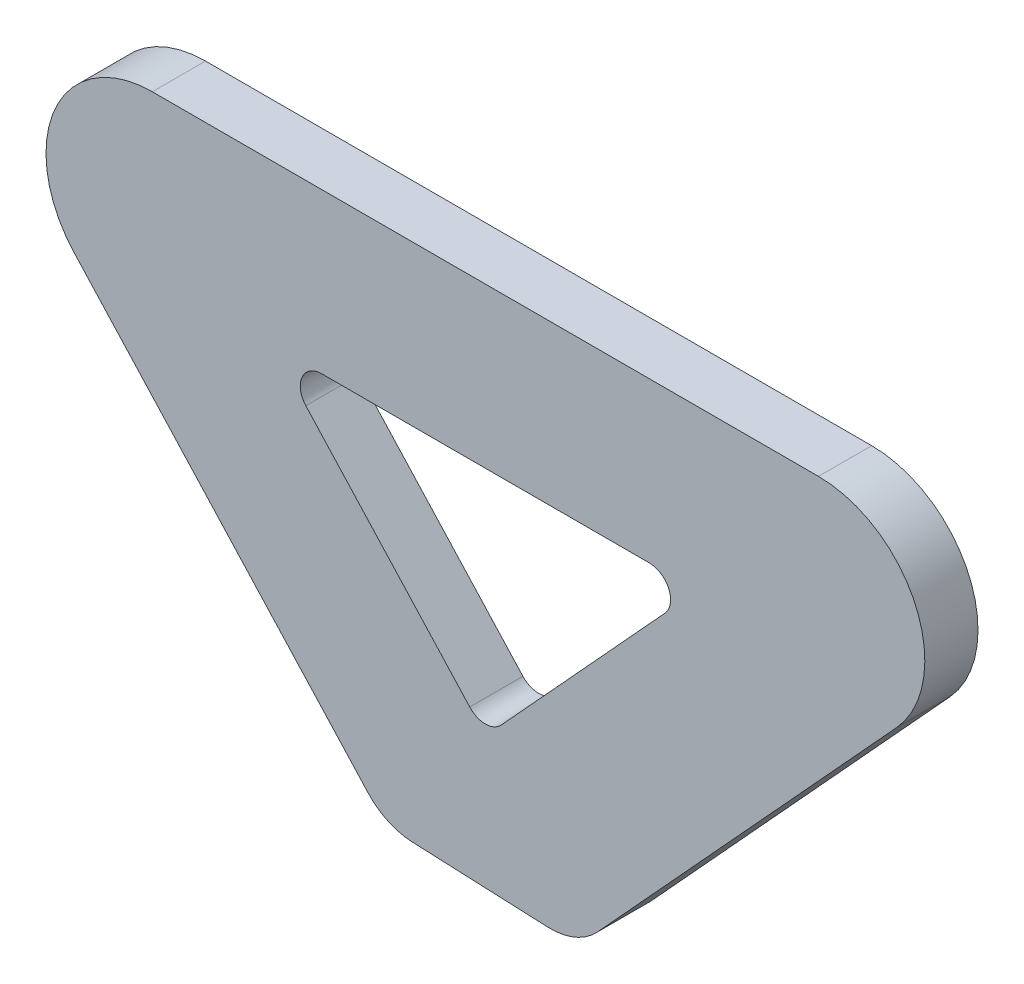
ISO-10303-21;
HEADER;
FILE_DESCRIPTION(('STEP AP214'),'2;1');
FILE_NAME('part.step','',(''),(''),'','','');
FILE_SCHEMA(('AUTOMOTIVE_DESIGN { 1 0 10303 214 1 1 1 1 }'));
ENDSEC;
DATA;
#1=APPLICATION_CONTEXT('core data for automotive mechanical design processes');
#2=APPLICATION_PROTOCOL_DEFINITION('international standard','automotive_design',2000,#1);
#3=PRODUCT_CONTEXT('',#1,'mechanical');
#4=PRODUCT('Part','Part','',(#3));
#5=PRODUCT_RELATED_PRODUCT_CATEGORY('part','',(#4));
#6=PRODUCT_DEFINITION_FORMATION('','',#4);
#7=PRODUCT_DEFINITION_CONTEXT('part definition',#1,'design');
#8=PRODUCT_DEFINITION('design','',#6,#7);
#9=PRODUCT_DEFINITION_SHAPE('','',#8);
#10=(LENGTH_UNIT() NAMED_UNIT(*) SI_UNIT(.MILLI.,.METRE.));
#11=(NAMED_UNIT(*) PLANE_ANGLE_UNIT() SI_UNIT($,.RADIAN.));
#12=(NAMED_UNIT(*) SI_UNIT($,.STERADIAN.) SOLID_ANGLE_UNIT());
#13=UNCERTAINTY_MEASURE_WITH_UNIT(LENGTH_MEASURE(1.E-05),#10,'distance_accuracy_value','');
#14=(GEOMETRIC_REPRESENTATION_CONTEXT(3) GLOBAL_UNCERTAINTY_ASSIGNED_CONTEXT((#13)) GLOBAL_UNIT_ASSIGNED_CONTEXT((#10,
#11,#12)) REPRESENTATION_CONTEXT('',''));
#15=CARTESIAN_POINT('',(0.,0.,0.));
#16=DIRECTION('',(0.,0.,1.));
#17=DIRECTION('',(1.,0.,0.));
#18=AXIS2_PLACEMENT_3D('',#15,#16,#17);
#19=CARTESIAN_POINT('',(39.7716912999365,-12.7000000000003,6.35));
#20=DIRECTION('',(0.,0.,1.));
#21=DIRECTION('',(1.,0.,0.));
#22=AXIS2_PLACEMENT_3D('',#19,#20,#21);
#23=PLANE('',#22);
#24=DIRECTION('',(-0.99904171323689,0.0437681986458256,0.));
#25=VECTOR('',#24,1.);
#26=CARTESIAN_POINT('',(37.5202773848138,-64.0901984673981,6.35));
#27=LINE('',#26,#25);
#28=CARTESIAN_POINT('',(-8.74868159884013,-62.0631469828602,6.35));
#29=VERTEX_POINT('',#28);
#30=CARTESIAN_POINT('',(7.4322700803087,-62.772037410545,6.35));
#31=VERTEX_POINT('',#30);
#32=EDGE_CURVE('E176',#29,#31,#27,.F.);
#33=ORIENTED_EDGE('',*,*,#32,.T.);
#34=CARTESIAN_POINT('',(7.7657837539899,-55.1593395556799,6.35));
#35=DIRECTION('',(0.,0.,1.));
#36=DIRECTION('',(1.,0.,0.));
#37=AXIS2_PLACEMENT_3D('',#34,#35,#36);
#38=CIRCLE('',#37,7.62);
#39=CARTESIAN_POINT('',(13.3846038105677,-60.306500051701,6.35));
#40=VERTEX_POINT('',#39);
#41=EDGE_CURVE('E48',#31,#40,#38,.T.);
#42=ORIENTED_EDGE('',*,*,#41,.T.);
#43=DIRECTION('',(0.675480380055254,0.737377960180808,0.));
#44=VECTOR('',#43,1.);
#45=CARTESIAN_POINT('',(-2.63677968348475E-13,-74.9176007543706,6.35));
#46=LINE('',#45,#44);
#47=CARTESIAN_POINT('',(49.1363913942325,-21.2786008267022,6.35));
#48=VERTEX_POINT('',#47);
#49=EDGE_CURVE('E142',#40,#48,#46,.T.);
#50=ORIENTED_EDGE('',*,*,#49,.T.);
#51=CARTESIAN_POINT('',(39.7716912999365,-12.7000000000003,6.35));
#52=DIRECTION('',(0.,0.,1.));
#53=DIRECTION('',(1.,0.,0.));
#54=AXIS2_PLACEMENT_3D('',#51,#52,#53);
#55=CIRCLE('',#54,12.7);
#56=CARTESIAN_POINT('',(39.7716912999363,-2.77555756156289E-13,6.35));
#57=VERTEX_POINT('',#56);
#58=EDGE_CURVE('E145',#48,#57,#55,.T.);
#59=ORIENTED_EDGE('',*,*,#58,.T.);
#60=DIRECTION('',(-1.,0.,0.));
#61=VECTOR('',#60,1.);
#62=CARTESIAN_POINT('',(39.7716912999363,-2.77555756156289E-13,6.35));
#63=LINE('',#62,#61);
#64=CARTESIAN_POINT('',(-39.7716912999363,0.,6.35));
#65=VERTEX_POINT('',#64);
#66=EDGE_CURVE('E164',#57,#65,#63,.T.);
#67=ORIENTED_EDGE('',*,*,#66,.T.);
#68=CARTESIAN_POINT('',(-39.7716912999365,-12.7,6.35));
#69=DIRECTION('',(0.,0.,1.));
#70=DIRECTION('',(-1.,0.,0.));
#71=AXIS2_PLACEMENT_3D('',#68,#69,#70);
#72=CIRCLE('',#71,12.7);
#73=CARTESIAN_POINT('',(-49.1363913942327,-21.2786008267019,6.35));
#74=VERTEX_POINT('',#73);
#75=EDGE_CURVE('E270',#65,#74,#72,.T.);
#76=ORIENTED_EDGE('',*,*,#75,.T.);
#77=DIRECTION('',(0.675480380055249,-0.737377960180813,0.));
#78=VECTOR('',#77,1.);
#79=CARTESIAN_POINT('',(-2.63677968348475E-13,-74.9176007543706,6.35));
#80=LINE('',#79,#78);
#81=CARTESIAN_POINT('',(-14.0339879817367,-59.5976096240161,6.35));
#82=VERTEX_POINT('',#81);
#83=EDGE_CURVE('E241',#74,#82,#80,.T.);
#84=ORIENTED_EDGE('',*,*,#83,.T.);
#85=CARTESIAN_POINT('',(-8.41516792515893,-54.4504491279951,6.35));
#86=DIRECTION('',(0.,0.,1.));
#87=DIRECTION('',(1.,0.,0.));
#88=AXIS2_PLACEMENT_3D('',#85,#86,#87);
#89=CIRCLE('',#88,7.62);
#90=EDGE_CURVE('E55',#82,#29,#89,.T.);
#91=ORIENTED_EDGE('',*,*,#90,.T.);
#92=EDGE_LOOP('',(#33,#42,#50,#59,#67,#76,#84,#91));
#93=FACE_BOUND('',#92,.T.);
#94=DIRECTION('',(0.675480380055254,0.737377960180808,0.));
#95=VECTOR('',#94,1.);
#96=CARTESIAN_POINT('',(-1.61329283265843E-13,-46.7154492744981,6.35));
#97=LINE('',#96,#95);
#98=CARTESIAN_POINT('',(1.8729400188591,-44.6708825758555,6.35));
#99=VERTEX_POINT('',#98);
#100=CARTESIAN_POINT('',(21.4446505992218,-23.3057201653403,6.35));
#101=VERTEX_POINT('',#100);
#102=EDGE_CURVE('E288',#99,#101,#97,.T.);
#103=ORIENTED_EDGE('',*,*,#102,.F.);
#104=CARTESIAN_POINT('',(-1.47885176327023E-13,-42.9551624105152,6.35));
#105=DIRECTION('',(0.,0.,1.));
#106=DIRECTION('',(1.,0.,0.));
#107=AXIS2_PLACEMENT_3D('',#104,#105,#106);
#108=CIRCLE('',#107,2.54);
#109=CARTESIAN_POINT('',(-1.87294001885941,-44.6708825758555,6.35));
#110=VERTEX_POINT('',#109);
#111=EDGE_CURVE('E214',#99,#110,#108,.F.);
#112=ORIENTED_EDGE('',*,*,#111,.T.);
#113=DIRECTION('',(0.675480380055249,-0.737377960180813,0.));
#114=VECTOR('',#113,1.);
#115=CARTESIAN_POINT('',(-1.61329283265843E-13,-46.7154492744981,6.35));
#116=LINE('',#115,#114);
#117=CARTESIAN_POINT('',(-21.4446505992219,-23.3057201653403,6.35));
#118=VERTEX_POINT('',#117);
#119=EDGE_CURVE('E295',#118,#110,#116,.T.);
#120=ORIENTED_EDGE('',*,*,#119,.F.);
#121=CARTESIAN_POINT('',(-19.5717105803626,-21.59,6.35));
#122=DIRECTION('',(0.,0.,1.));
#123=DIRECTION('',(1.,0.,0.));
#124=AXIS2_PLACEMENT_3D('',#121,#122,#123);
#125=CIRCLE('',#124,2.54);
#126=CARTESIAN_POINT('',(-19.5717105803626,-19.0499999999999,6.35));
#127=VERTEX_POINT('',#126);
#128=EDGE_CURVE('E208',#118,#127,#125,.F.);
#129=ORIENTED_EDGE('',*,*,#128,.T.);
#130=DIRECTION('',(-1.,0.,0.));
#131=VECTOR('',#130,1.);
#132=CARTESIAN_POINT('',(25.3431336430979,-19.0500000000002,6.35));
#133=LINE('',#132,#131);
#134=CARTESIAN_POINT('',(19.5717105803626,-19.0500000000001,6.35));
#135=VERTEX_POINT('',#134);
#136=EDGE_CURVE('E285',#135,#127,#133,.T.);
#137=ORIENTED_EDGE('',*,*,#136,.F.);
#138=CARTESIAN_POINT('',(19.5717105803626,-21.59,6.35));
#139=DIRECTION('',(0.,0.,1.));
#140=DIRECTION('',(1.,0.,0.));
#141=AXIS2_PLACEMENT_3D('',#138,#139,#140);
#142=CIRCLE('',#141,2.54);
#143=EDGE_CURVE('E220',#135,#101,#142,.F.);
#144=ORIENTED_EDGE('',*,*,#143,.T.);
#145=EDGE_LOOP('',(#103,#112,#120,#129,#137,#144));
#146=FACE_BOUND('',#145,.T.);
#147=ADVANCED_FACE('F39',(#93,#146),#23,.T.);
#148=CARTESIAN_POINT('',(39.7716912999365,-12.7000000000003,0.));
#149=DIRECTION('',(0.,0.,1.));
#150=DIRECTION('',(1.,0.,0.));
#151=AXIS2_PLACEMENT_3D('',#148,#149,#150);
#152=PLANE('',#151);
#153=DIRECTION('',(0.675480380055254,0.737377960180808,0.));
#154=VECTOR('',#153,1.);
#155=CARTESIAN_POINT('',(-2.63677968348475E-13,-74.9176007543706,0.));
#156=LINE('',#155,#154);
#157=CARTESIAN_POINT('',(13.3846038105677,-60.306500051701,0.));
#158=VERTEX_POINT('',#157);
#159=CARTESIAN_POINT('',(49.1363913942325,-21.2786008267022,0.));
#160=VERTEX_POINT('',#159);
#161=EDGE_CURVE('E168',#158,#160,#156,.T.);
#162=ORIENTED_EDGE('',*,*,#161,.F.);
#163=CARTESIAN_POINT('',(7.7657837539899,-55.1593395556799,0.));
#164=DIRECTION('',(0.,0.,1.));
#165=DIRECTION('',(1.,0.,0.));
#166=AXIS2_PLACEMENT_3D('',#163,#164,#165);
#167=CIRCLE('',#166,7.62);
#168=CARTESIAN_POINT('',(7.43227008030871,-62.772037410545,0.));
#169=VERTEX_POINT('',#168);
#170=EDGE_CURVE('E229',#158,#169,#167,.F.);
#171=ORIENTED_EDGE('',*,*,#170,.T.);
#172=DIRECTION('',(0.99904171323689,-0.0437681986458256,0.));
#173=VECTOR('',#172,1.);
#174=CARTESIAN_POINT('',(10.9835099901653,-62.9276178750584,0.));
#175=LINE('',#174,#173);
#176=CARTESIAN_POINT('',(-8.74868159884012,-62.0631469828602,0.));
#177=VERTEX_POINT('',#176);
#178=EDGE_CURVE('E171',#169,#177,#175,.F.);
#179=ORIENTED_EDGE('',*,*,#178,.T.);
#180=CARTESIAN_POINT('',(-8.41516792515893,-54.4504491279951,0.));
#181=DIRECTION('',(0.,0.,1.));
#182=DIRECTION('',(1.,0.,0.));
#183=AXIS2_PLACEMENT_3D('',#180,#181,#182);
#184=CIRCLE('',#183,7.62);
#185=CARTESIAN_POINT('',(-14.0339879817367,-59.5976096240161,0.));
#186=VERTEX_POINT('',#185);
#187=EDGE_CURVE('E226',#177,#186,#184,.F.);
#188=ORIENTED_EDGE('',*,*,#187,.T.);
#189=DIRECTION('',(0.675480380055249,-0.737377960180813,0.));
#190=VECTOR('',#189,1.);
#191=CARTESIAN_POINT('',(-2.63677968348475E-13,-74.9176007543706,0.));
#192=LINE('',#191,#190);
#193=CARTESIAN_POINT('',(-49.1363913942327,-21.2786008267019,0.));
#194=VERTEX_POINT('',#193);
#195=EDGE_CURVE('E153',#194,#186,#192,.T.);
#196=ORIENTED_EDGE('',*,*,#195,.F.);
#197=CARTESIAN_POINT('',(-39.7716912999365,-12.7,0.));
#198=DIRECTION('',(0.,0.,1.));
#199=DIRECTION('',(-1.,0.,0.));
#200=AXIS2_PLACEMENT_3D('',#197,#198,#199);
#201=CIRCLE('',#200,12.7);
#202=CARTESIAN_POINT('',(-39.7716912999363,0.,0.));
#203=VERTEX_POINT('',#202);
#204=EDGE_CURVE('E256',#203,#194,#201,.T.);
#205=ORIENTED_EDGE('',*,*,#204,.F.);
#206=DIRECTION('',(-1.,0.,0.));
#207=VECTOR('',#206,1.);
#208=CARTESIAN_POINT('',(-39.7716912999363,0.,0.));
#209=LINE('',#208,#207);
#210=CARTESIAN_POINT('',(39.7716912999363,-2.77555756156289E-13,0.));
#211=VERTEX_POINT('',#210);
#212=EDGE_CURVE('E259',#211,#203,#209,.T.);
#213=ORIENTED_EDGE('',*,*,#212,.F.);
#214=CARTESIAN_POINT('',(39.7716912999365,-12.7000000000003,0.));
#215=DIRECTION('',(0.,0.,1.));
#216=DIRECTION('',(1.,0.,0.));
#217=AXIS2_PLACEMENT_3D('',#214,#215,#216);
#218=CIRCLE('',#217,12.7);
#219=EDGE_CURVE('E272',#160,#211,#218,.T.);
#220=ORIENTED_EDGE('',*,*,#219,.F.);
#221=EDGE_LOOP('',(#162,#171,#179,#188,#196,#205,#213,#220));
#222=FACE_BOUND('',#221,.T.);
#223=DIRECTION('',(-1.,0.,0.));
#224=VECTOR('',#223,1.);
#225=CARTESIAN_POINT('',(-25.343133643098,-19.05,0.));
#226=LINE('',#225,#224);
#227=CARTESIAN_POINT('',(19.5717105803626,-19.05,0.));
#228=VERTEX_POINT('',#227);
#229=CARTESIAN_POINT('',(-19.5717105803626,-19.05,0.));
#230=VERTEX_POINT('',#229);
#231=EDGE_CURVE('E307',#228,#230,#226,.T.);
#232=ORIENTED_EDGE('',*,*,#231,.T.);
#233=CARTESIAN_POINT('',(-19.5717105803626,-21.59,0.));
#234=DIRECTION('',(0.,0.,1.));
#235=DIRECTION('',(1.,0.,0.));
#236=AXIS2_PLACEMENT_3D('',#233,#234,#235);
#237=CIRCLE('',#236,2.54);
#238=CARTESIAN_POINT('',(-21.4446505992219,-23.3057201653403,0.));
#239=VERTEX_POINT('',#238);
#240=EDGE_CURVE('E205',#230,#239,#237,.T.);
#241=ORIENTED_EDGE('',*,*,#240,.T.);
#242=DIRECTION('',(0.675480380055249,-0.737377960180813,0.));
#243=VECTOR('',#242,1.);
#244=CARTESIAN_POINT('',(-1.61329283265843E-13,-46.7154492744981,0.));
#245=LINE('',#244,#243);
#246=CARTESIAN_POINT('',(-1.87294001885941,-44.6708825758555,0.));
#247=VERTEX_POINT('',#246);
#248=EDGE_CURVE('E299',#239,#247,#245,.T.);
#249=ORIENTED_EDGE('',*,*,#248,.T.);
#250=CARTESIAN_POINT('',(-1.47885176327023E-13,-42.9551624105152,0.));
#251=DIRECTION('',(0.,0.,1.));
#252=DIRECTION('',(1.,0.,0.));
#253=AXIS2_PLACEMENT_3D('',#250,#251,#252);
#254=CIRCLE('',#253,2.54);
#255=CARTESIAN_POINT('',(1.8729400188591,-44.6708825758555,0.));
#256=VERTEX_POINT('',#255);
#257=EDGE_CURVE('E211',#247,#256,#254,.T.);
#258=ORIENTED_EDGE('',*,*,#257,.T.);
#259=DIRECTION('',(0.675480380055254,0.737377960180808,0.));
#260=VECTOR('',#259,1.);
#261=CARTESIAN_POINT('',(-1.61329283265843E-13,-46.7154492744981,0.));
#262=LINE('',#261,#260);
#263=CARTESIAN_POINT('',(21.4446505992218,-23.3057201653403,0.));
#264=VERTEX_POINT('',#263);
#265=EDGE_CURVE('E303',#256,#264,#262,.T.);
#266=ORIENTED_EDGE('',*,*,#265,.T.);
#267=CARTESIAN_POINT('',(19.5717105803626,-21.59,0.));
#268=DIRECTION('',(0.,0.,1.));
#269=DIRECTION('',(1.,0.,0.));
#270=AXIS2_PLACEMENT_3D('',#267,#268,#269);
#271=CIRCLE('',#270,2.54);
#272=EDGE_CURVE('E217',#264,#228,#271,.T.);
#273=ORIENTED_EDGE('',*,*,#272,.T.);
#274=EDGE_LOOP('',(#232,#241,#249,#258,#266,#273));
#275=FACE_BOUND('',#274,.T.);
#276=ADVANCED_FACE('F247',(#222,#275),#152,.F.);
#277=CARTESIAN_POINT('',(-2.63677968348475E-13,-74.9176007543706,6.35));
#278=DIRECTION('',(-0.737377960180808,0.675480380055254,0.));
#279=DIRECTION('',(-0.675480380055254,-0.737377960180808,0.));
#280=AXIS2_PLACEMENT_3D('',#277,#278,#279);
#281=PLANE('',#280);
#282=ORIENTED_EDGE('',*,*,#49,.F.);
#283=DIRECTION('',(0.,0.,1.));
#284=VECTOR('',#283,1.);
#285=CARTESIAN_POINT('',(13.3846038105677,-60.306500051701,0.));
#286=LINE('',#285,#284);
#287=EDGE_CURVE('E223',#40,#158,#286,.F.);
#288=ORIENTED_EDGE('',*,*,#287,.T.);
#289=ORIENTED_EDGE('',*,*,#161,.T.);
#290=DIRECTION('',(0.,0.,-1.));
#291=VECTOR('',#290,1.);
#292=CARTESIAN_POINT('',(49.1363913942325,-21.2786008267022,6.35));
#293=LINE('',#292,#291);
#294=EDGE_CURVE('E159',#48,#160,#293,.T.);
#295=ORIENTED_EDGE('',*,*,#294,.F.);
#296=EDGE_LOOP('',(#282,#288,#289,#295));
#297=FACE_BOUND('',#296,.T.);
#298=ADVANCED_FACE('F166',(#297),#281,.F.);
#299=CARTESIAN_POINT('',(39.7716912999365,-12.7000000000003,6.35));
#300=DIRECTION('',(0.,0.,-1.));
#301=DIRECTION('',(-1.,0.,0.));
#302=AXIS2_PLACEMENT_3D('',#299,#300,#301);
#303=CYLINDRICAL_SURFACE('',#302,12.7);
#304=ORIENTED_EDGE('',*,*,#219,.T.);
#305=DIRECTION('',(0.,0.,-1.));
#306=VECTOR('',#305,1.);
#307=CARTESIAN_POINT('',(39.7716912999363,-2.77555756156289E-13,6.35));
#308=LINE('',#307,#306);
#309=EDGE_CURVE('E161',#57,#211,#308,.T.);
#310=ORIENTED_EDGE('',*,*,#309,.F.);
#311=ORIENTED_EDGE('',*,*,#58,.F.);
#312=ORIENTED_EDGE('',*,*,#294,.T.);
#313=EDGE_LOOP('',(#304,#310,#311,#312));
#314=FACE_BOUND('',#313,.T.);
#315=ADVANCED_FACE('F158',(#314),#303,.T.);
#316=CARTESIAN_POINT('',(-39.7716912999363,0.,6.35));
#317=DIRECTION('',(0.,-1.,0.));
#318=DIRECTION('',(0.,0.,-1.));
#319=AXIS2_PLACEMENT_3D('',#316,#317,#318);
#320=PLANE('',#319);
#321=ORIENTED_EDGE('',*,*,#212,.T.);
#322=DIRECTION('',(0.,0.,-1.));
#323=VECTOR('',#322,1.);
#324=CARTESIAN_POINT('',(-39.7716912999363,0.,6.35));
#325=LINE('',#324,#323);
#326=EDGE_CURVE('E178',#65,#203,#325,.T.);
#327=ORIENTED_EDGE('',*,*,#326,.F.);
#328=ORIENTED_EDGE('',*,*,#66,.F.);
#329=ORIENTED_EDGE('',*,*,#309,.T.);
#330=EDGE_LOOP('',(#321,#327,#328,#329));
#331=FACE_BOUND('',#330,.T.);
#332=ADVANCED_FACE('F276',(#331),#320,.F.);
#333=CARTESIAN_POINT('',(-39.7716912999365,-12.7,6.35));
#334=DIRECTION('',(0.,0.,-1.));
#335=DIRECTION('',(-1.,0.,0.));
#336=AXIS2_PLACEMENT_3D('',#333,#334,#335);
#337=CYLINDRICAL_SURFACE('',#336,12.7);
#338=ORIENTED_EDGE('',*,*,#204,.T.);
#339=DIRECTION('',(0.,0.,-1.));
#340=VECTOR('',#339,1.);
#341=CARTESIAN_POINT('',(-49.1363913942327,-21.2786008267019,6.35));
#342=LINE('',#341,#340);
#343=EDGE_CURVE('E254',#74,#194,#342,.T.);
#344=ORIENTED_EDGE('',*,*,#343,.F.);
#345=ORIENTED_EDGE('',*,*,#75,.F.);
#346=ORIENTED_EDGE('',*,*,#326,.T.);
#347=EDGE_LOOP('',(#338,#344,#345,#346));
#348=FACE_BOUND('',#347,.T.);
#349=ADVANCED_FACE('F269',(#348),#337,.T.);
#350=CARTESIAN_POINT('',(-2.63677968348475E-13,-74.9176007543706,6.35));
#351=DIRECTION('',(0.737377960180813,0.675480380055249,0.));
#352=DIRECTION('',(-0.675480380055249,0.737377960180813,0.));
#353=AXIS2_PLACEMENT_3D('',#350,#351,#352);
#354=PLANE('',#353);
#355=ORIENTED_EDGE('',*,*,#195,.T.);
#356=DIRECTION('',(0.,0.,-1.));
#357=VECTOR('',#356,1.);
#358=CARTESIAN_POINT('',(-14.0339879817367,-59.5976096240161,6.35));
#359=LINE('',#358,#357);
#360=EDGE_CURVE('E11',#186,#82,#359,.F.);
#361=ORIENTED_EDGE('',*,*,#360,.T.);
#362=ORIENTED_EDGE('',*,*,#83,.F.);
#363=ORIENTED_EDGE('',*,*,#343,.T.);
#364=EDGE_LOOP('',(#355,#361,#362,#363));
#365=FACE_BOUND('',#364,.T.);
#366=ADVANCED_FACE('F252',(#365),#354,.F.);
#367=CARTESIAN_POINT('',(-1.61329283265843E-13,-46.7154492744981,6.35));
#368=DIRECTION('',(0.737377960180813,0.675480380055249,0.));
#369=DIRECTION('',(-0.675480380055249,0.737377960180813,0.));
#370=AXIS2_PLACEMENT_3D('',#367,#368,#369);
#371=PLANE('',#370);
#372=ORIENTED_EDGE('',*,*,#248,.F.);
#373=DIRECTION('',(0.,0.,-1.));
#374=VECTOR('',#373,1.);
#375=CARTESIAN_POINT('',(-21.4446505992219,-23.3057201653403,6.35));
#376=LINE('',#375,#374);
#377=EDGE_CURVE('E195',#239,#118,#376,.F.);
#378=ORIENTED_EDGE('',*,*,#377,.T.);
#379=ORIENTED_EDGE('',*,*,#119,.T.);
#380=DIRECTION('',(0.,0.,-1.));
#381=VECTOR('',#380,1.);
#382=CARTESIAN_POINT('',(-1.87294001885941,-44.6708825758555,0.));
#383=LINE('',#382,#381);
#384=EDGE_CURVE('E191',#110,#247,#383,.T.);
#385=ORIENTED_EDGE('',*,*,#384,.T.);
#386=EDGE_LOOP('',(#372,#378,#379,#385));
#387=FACE_BOUND('',#386,.T.);
#388=ADVANCED_FACE('F317',(#387),#371,.T.);
#389=CARTESIAN_POINT('',(-1.61329283265843E-13,-46.7154492744981,6.35));
#390=DIRECTION('',(-0.737377960180808,0.675480380055254,0.));
#391=DIRECTION('',(-0.675480380055254,-0.737377960180808,0.));
#392=AXIS2_PLACEMENT_3D('',#389,#390,#391);
#393=PLANE('',#392);
#394=ORIENTED_EDGE('',*,*,#265,.F.);
#395=DIRECTION('',(0.,0.,-1.));
#396=VECTOR('',#395,1.);
#397=CARTESIAN_POINT('',(1.8729400188591,-44.6708825758555,6.35));
#398=LINE('',#397,#396);
#399=EDGE_CURVE('E202',#256,#99,#398,.F.);
#400=ORIENTED_EDGE('',*,*,#399,.T.);
#401=ORIENTED_EDGE('',*,*,#102,.T.);
#402=DIRECTION('',(0.,0.,-1.));
#403=VECTOR('',#402,1.);
#404=CARTESIAN_POINT('',(21.4446505992218,-23.3057201653403,0.));
#405=LINE('',#404,#403);
#406=EDGE_CURVE('E198',#101,#264,#405,.T.);
#407=ORIENTED_EDGE('',*,*,#406,.T.);
#408=EDGE_LOOP('',(#394,#400,#401,#407));
#409=FACE_BOUND('',#408,.T.);
#410=ADVANCED_FACE('F326',(#409),#393,.T.);
#411=CARTESIAN_POINT('',(-25.343133643098,-19.05,6.35));
#412=DIRECTION('',(0.,-1.,0.));
#413=DIRECTION('',(1.,0.,0.));
#414=AXIS2_PLACEMENT_3D('',#411,#412,#413);
#415=PLANE('',#414);
#416=ORIENTED_EDGE('',*,*,#136,.T.);
#417=DIRECTION('',(0.,0.,-1.));
#418=VECTOR('',#417,1.);
#419=CARTESIAN_POINT('',(-19.5717105803626,-19.05,0.));
#420=LINE('',#419,#418);
#421=EDGE_CURVE('E187',#127,#230,#420,.T.);
#422=ORIENTED_EDGE('',*,*,#421,.T.);
#423=ORIENTED_EDGE('',*,*,#231,.F.);
#424=DIRECTION('',(0.,0.,-1.));
#425=VECTOR('',#424,1.);
#426=CARTESIAN_POINT('',(19.5717105803626,-19.05,6.35));
#427=LINE('',#426,#425);
#428=EDGE_CURVE('E184',#228,#135,#427,.F.);
#429=ORIENTED_EDGE('',*,*,#428,.T.);
#430=EDGE_LOOP('',(#416,#422,#423,#429));
#431=FACE_BOUND('',#430,.T.);
#432=ADVANCED_FACE('F333',(#431),#415,.T.);
#433=CARTESIAN_POINT('',(10.9835099901653,-62.9276178750584,6.35));
#434=DIRECTION('',(0.0437681986458256,0.99904171323689,0.));
#435=DIRECTION('',(0.,0.,-1.));
#436=AXIS2_PLACEMENT_3D('',#433,#434,#435);
#437=PLANE('',#436);
#438=ORIENTED_EDGE('',*,*,#178,.F.);
#439=DIRECTION('',(0.,0.,-1.));
#440=VECTOR('',#439,1.);
#441=CARTESIAN_POINT('',(7.43227008030871,-62.772037410545,6.35));
#442=LINE('',#441,#440);
#443=EDGE_CURVE('E62',#169,#31,#442,.F.);
#444=ORIENTED_EDGE('',*,*,#443,.T.);
#445=ORIENTED_EDGE('',*,*,#32,.F.);
#446=DIRECTION('',(0.,0.,1.));
#447=VECTOR('',#446,1.);
#448=CARTESIAN_POINT('',(-8.74868159884012,-62.0631469828602,0.));
#449=LINE('',#448,#447);
#450=EDGE_CURVE('E232',#29,#177,#449,.F.);
#451=ORIENTED_EDGE('',*,*,#450,.T.);
#452=EDGE_LOOP('',(#438,#444,#445,#451));
#453=FACE_BOUND('',#452,.T.);
#454=ADVANCED_FACE('F242',(#453),#437,.F.);
#455=CARTESIAN_POINT('',(-19.5717105803626,-21.59,6.35));
#456=DIRECTION('',(0.,0.,1.));
#457=DIRECTION('',(1.,0.,0.));
#458=AXIS2_PLACEMENT_3D('',#455,#456,#457);
#459=CYLINDRICAL_SURFACE('',#458,2.54);
#460=ORIENTED_EDGE('',*,*,#128,.F.);
#461=ORIENTED_EDGE('',*,*,#377,.F.);
#462=ORIENTED_EDGE('',*,*,#240,.F.);
#463=ORIENTED_EDGE('',*,*,#421,.F.);
#464=EDGE_LOOP('',(#460,#461,#462,#463));
#465=FACE_BOUND('',#464,.T.);
#466=ADVANCED_FACE('F335',(#465),#459,.F.);
#467=CARTESIAN_POINT('',(-1.47885176327023E-13,-42.9551624105152,6.35));
#468=DIRECTION('',(0.,0.,1.));
#469=DIRECTION('',(1.,0.,0.));
#470=AXIS2_PLACEMENT_3D('',#467,#468,#469);
#471=CYLINDRICAL_SURFACE('',#470,2.54);
#472=ORIENTED_EDGE('',*,*,#111,.F.);
#473=ORIENTED_EDGE('',*,*,#399,.F.);
#474=ORIENTED_EDGE('',*,*,#257,.F.);
#475=ORIENTED_EDGE('',*,*,#384,.F.);
#476=EDGE_LOOP('',(#472,#473,#474,#475));
#477=FACE_BOUND('',#476,.T.);
#478=ADVANCED_FACE('F322',(#477),#471,.F.);
#479=CARTESIAN_POINT('',(19.5717105803626,-21.59,6.35));
#480=DIRECTION('',(0.,0.,1.));
#481=DIRECTION('',(1.,0.,0.));
#482=AXIS2_PLACEMENT_3D('',#479,#480,#481);
#483=CYLINDRICAL_SURFACE('',#482,2.54);
#484=ORIENTED_EDGE('',*,*,#143,.F.);
#485=ORIENTED_EDGE('',*,*,#428,.F.);
#486=ORIENTED_EDGE('',*,*,#272,.F.);
#487=ORIENTED_EDGE('',*,*,#406,.F.);
#488=EDGE_LOOP('',(#484,#485,#486,#487));
#489=FACE_BOUND('',#488,.T.);
#490=ADVANCED_FACE('F331',(#489),#483,.F.);
#491=CARTESIAN_POINT('',(7.7657837539899,-55.1593395556799,6.35));
#492=DIRECTION('',(0.,0.,-1.));
#493=DIRECTION('',(-1.,0.,0.));
#494=AXIS2_PLACEMENT_3D('',#491,#492,#493);
#495=CYLINDRICAL_SURFACE('',#494,7.62);
#496=ORIENTED_EDGE('',*,*,#41,.F.);
#497=ORIENTED_EDGE('',*,*,#443,.F.);
#498=ORIENTED_EDGE('',*,*,#170,.F.);
#499=ORIENTED_EDGE('',*,*,#287,.F.);
#500=EDGE_LOOP('',(#496,#497,#498,#499));
#501=FACE_BOUND('',#500,.T.);
#502=ADVANCED_FACE('F362',(#501),#495,.T.);
#503=CARTESIAN_POINT('',(-8.41516792515893,-54.4504491279951,6.35));
#504=DIRECTION('',(0.,0.,1.));
#505=DIRECTION('',(1.,0.,0.));
#506=AXIS2_PLACEMENT_3D('',#503,#504,#505);
#507=CYLINDRICAL_SURFACE('',#506,7.62);
#508=ORIENTED_EDGE('',*,*,#187,.F.);
#509=ORIENTED_EDGE('',*,*,#450,.F.);
#510=ORIENTED_EDGE('',*,*,#90,.F.);
#511=ORIENTED_EDGE('',*,*,#360,.F.);
#512=EDGE_LOOP('',(#508,#509,#510,#511));
#513=FACE_BOUND('',#512,.T.);
#514=ADVANCED_FACE('F41',(#513),#507,.T.);
#515=CLOSED_SHELL('',(#147,#276,#298,#315,#332,#349,#366,#388,#410,#432,#454,#466,#478,#490,
#502,#514));
#516=MANIFOLD_SOLID_BREP('B2',#515);
#517=ADVANCED_BREP_SHAPE_REPRESENTATION('',(#18,#516),#14);
#518=SHAPE_DEFINITION_REPRESENTATION(#9,#517);
ENDSEC;
END-ISO-10303-21;
